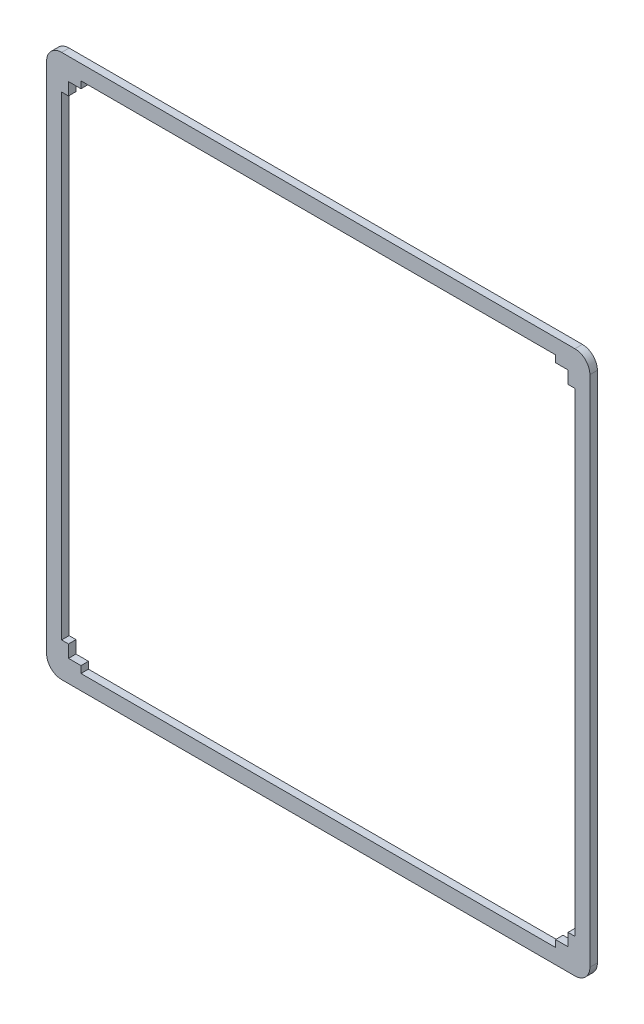
ISO-10303-21;
HEADER;
FILE_DESCRIPTION(('STEP AP214'),'2;1');
FILE_NAME('part.step','',(''),(''),'','','');
FILE_SCHEMA(('AUTOMOTIVE_DESIGN { 1 0 10303 214 1 1 1 1 }'));
ENDSEC;
DATA;
#1=APPLICATION_CONTEXT('core data for automotive mechanical design processes');
#2=APPLICATION_PROTOCOL_DEFINITION('international standard','automotive_design',2000,#1);
#3=PRODUCT_CONTEXT('',#1,'mechanical');
#4=PRODUCT('Part','Part','',(#3));
#5=PRODUCT_RELATED_PRODUCT_CATEGORY('part','',(#4));
#6=PRODUCT_DEFINITION_FORMATION('','',#4);
#7=PRODUCT_DEFINITION_CONTEXT('part definition',#1,'design');
#8=PRODUCT_DEFINITION('design','',#6,#7);
#9=PRODUCT_DEFINITION_SHAPE('','',#8);
#10=(LENGTH_UNIT() NAMED_UNIT(*) SI_UNIT(.MILLI.,.METRE.));
#11=(NAMED_UNIT(*) PLANE_ANGLE_UNIT() SI_UNIT($,.RADIAN.));
#12=(NAMED_UNIT(*) SI_UNIT($,.STERADIAN.) SOLID_ANGLE_UNIT());
#13=UNCERTAINTY_MEASURE_WITH_UNIT(LENGTH_MEASURE(1.E-05),#10,'distance_accuracy_value','');
#14=(GEOMETRIC_REPRESENTATION_CONTEXT(3) GLOBAL_UNCERTAINTY_ASSIGNED_CONTEXT((#13)) GLOBAL_UNIT_ASSIGNED_CONTEXT((#10,
#11,#12)) REPRESENTATION_CONTEXT('',''));
#15=CARTESIAN_POINT('',(0.,0.,0.));
#16=DIRECTION('',(0.,0.,1.));
#17=DIRECTION('',(1.,0.,0.));
#18=AXIS2_PLACEMENT_3D('',#15,#16,#17);
#19=CARTESIAN_POINT('',(-8.75,0.,3.));
#20=DIRECTION('',(1.,0.,0.));
#21=DIRECTION('',(0.,1.,0.));
#22=AXIS2_PLACEMENT_3D('',#19,#20,#21);
#23=PLANE('',#22);
#24=DIRECTION('',(0.,-1.,0.));
#25=VECTOR('',#24,1.);
#26=CARTESIAN_POINT('',(-8.75,0.,0.));
#27=LINE('',#26,#25);
#28=CARTESIAN_POINT('',(-8.75000000000003,202.75,0.));
#29=VERTEX_POINT('',#28);
#30=CARTESIAN_POINT('',(-8.75,-2.74999999999999,0.));
#31=VERTEX_POINT('',#30);
#32=EDGE_CURVE('E344',#29,#31,#27,.T.);
#33=ORIENTED_EDGE('',*,*,#32,.T.);
#34=DIRECTION('',(0.,0.,-1.));
#35=VECTOR('',#34,1.);
#36=CARTESIAN_POINT('',(-8.75,-2.74999999999999,3.));
#37=LINE('',#36,#35);
#38=CARTESIAN_POINT('',(-8.75,-2.74999999999999,3.));
#39=VERTEX_POINT('',#38);
#40=EDGE_CURVE('E11',#39,#31,#37,.T.);
#41=ORIENTED_EDGE('',*,*,#40,.F.);
#42=DIRECTION('',(0.,-1.,0.));
#43=VECTOR('',#42,1.);
#44=CARTESIAN_POINT('',(-8.75,0.,3.));
#45=LINE('',#44,#43);
#46=CARTESIAN_POINT('',(-8.75000000000003,202.75,3.));
#47=VERTEX_POINT('',#46);
#48=EDGE_CURVE('E930',#47,#39,#45,.T.);
#49=ORIENTED_EDGE('',*,*,#48,.F.);
#50=DIRECTION('',(0.,0.,-1.));
#51=VECTOR('',#50,1.);
#52=CARTESIAN_POINT('',(-8.75000000000003,202.75,3.));
#53=LINE('',#52,#51);
#54=EDGE_CURVE('E61',#47,#29,#53,.T.);
#55=ORIENTED_EDGE('',*,*,#54,.T.);
#56=EDGE_LOOP('',(#33,#41,#49,#55));
#57=FACE_BOUND('',#56,.T.);
#58=ADVANCED_FACE('F41',(#57),#23,.F.);
#59=CARTESIAN_POINT('',(-2.75,-2.75,3.));
#60=DIRECTION('',(0.,0.,-1.));
#61=DIRECTION('',(-1.,0.,0.));
#62=AXIS2_PLACEMENT_3D('',#59,#60,#61);
#63=CYLINDRICAL_SURFACE('',#62,5.99999999999999);
#64=CARTESIAN_POINT('',(-2.75,-2.75,0.));
#65=DIRECTION('',(0.,0.,1.));
#66=DIRECTION('',(1.,0.,0.));
#67=AXIS2_PLACEMENT_3D('',#64,#65,#66);
#68=CIRCLE('',#67,5.99999999999999);
#69=CARTESIAN_POINT('',(-2.75000000000004,-8.74999999999999,0.));
#70=VERTEX_POINT('',#69);
#71=EDGE_CURVE('E347',#31,#70,#68,.T.);
#72=ORIENTED_EDGE('',*,*,#71,.T.);
#73=DIRECTION('',(0.,0.,-1.));
#74=VECTOR('',#73,1.);
#75=CARTESIAN_POINT('',(-2.75000000000004,-8.74999999999999,3.));
#76=LINE('',#75,#74);
#77=CARTESIAN_POINT('',(-2.75000000000004,-8.74999999999999,3.));
#78=VERTEX_POINT('',#77);
#79=EDGE_CURVE('E52',#78,#70,#76,.T.);
#80=ORIENTED_EDGE('',*,*,#79,.F.);
#81=CARTESIAN_POINT('',(-2.75,-2.75,3.));
#82=DIRECTION('',(0.,0.,1.));
#83=DIRECTION('',(1.,0.,0.));
#84=AXIS2_PLACEMENT_3D('',#81,#82,#83);
#85=CIRCLE('',#84,5.99999999999999);
#86=EDGE_CURVE('E927',#39,#78,#85,.T.);
#87=ORIENTED_EDGE('',*,*,#86,.F.);
#88=ORIENTED_EDGE('',*,*,#40,.T.);
#89=EDGE_LOOP('',(#72,#80,#87,#88));
#90=FACE_BOUND('',#89,.T.);
#91=ADVANCED_FACE('F559',(#90),#63,.T.);
#92=CARTESIAN_POINT('',(0.,-8.74999999999999,3.));
#93=DIRECTION('',(0.,1.,0.));
#94=DIRECTION('',(-1.,0.,0.));
#95=AXIS2_PLACEMENT_3D('',#92,#93,#94);
#96=PLANE('',#95);
#97=DIRECTION('',(1.,0.,0.));
#98=VECTOR('',#97,1.);
#99=CARTESIAN_POINT('',(0.,-8.74999999999999,0.));
#100=LINE('',#99,#98);
#101=CARTESIAN_POINT('',(202.75,-8.75,0.));
#102=VERTEX_POINT('',#101);
#103=EDGE_CURVE('E350',#70,#102,#100,.T.);
#104=ORIENTED_EDGE('',*,*,#103,.T.);
#105=DIRECTION('',(0.,0.,-1.));
#106=VECTOR('',#105,1.);
#107=CARTESIAN_POINT('',(202.75,-8.75,3.));
#108=LINE('',#107,#106);
#109=CARTESIAN_POINT('',(202.75,-8.75,3.));
#110=VERTEX_POINT('',#109);
#111=EDGE_CURVE('E379',#110,#102,#108,.T.);
#112=ORIENTED_EDGE('',*,*,#111,.F.);
#113=DIRECTION('',(1.,0.,0.));
#114=VECTOR('',#113,1.);
#115=CARTESIAN_POINT('',(0.,-8.74999999999999,3.));
#116=LINE('',#115,#114);
#117=EDGE_CURVE('E922',#78,#110,#116,.T.);
#118=ORIENTED_EDGE('',*,*,#117,.F.);
#119=ORIENTED_EDGE('',*,*,#79,.T.);
#120=EDGE_LOOP('',(#104,#112,#118,#119));
#121=FACE_BOUND('',#120,.T.);
#122=ADVANCED_FACE('F564',(#121),#96,.F.);
#123=CARTESIAN_POINT('',(202.75,-2.74999999999998,3.));
#124=DIRECTION('',(0.,0.,-1.));
#125=DIRECTION('',(-1.,0.,0.));
#126=AXIS2_PLACEMENT_3D('',#123,#124,#125);
#127=CYLINDRICAL_SURFACE('',#126,6.00000000000003);
#128=CARTESIAN_POINT('',(202.75,-2.74999999999998,0.));
#129=DIRECTION('',(0.,0.,1.));
#130=DIRECTION('',(1.,0.,0.));
#131=AXIS2_PLACEMENT_3D('',#128,#129,#130);
#132=CIRCLE('',#131,6.00000000000003);
#133=CARTESIAN_POINT('',(208.75,-2.75,0.));
#134=VERTEX_POINT('',#133);
#135=EDGE_CURVE('E353',#102,#134,#132,.T.);
#136=ORIENTED_EDGE('',*,*,#135,.T.);
#137=DIRECTION('',(0.,0.,-1.));
#138=VECTOR('',#137,1.);
#139=CARTESIAN_POINT('',(208.75,-2.75,3.));
#140=LINE('',#139,#138);
#141=CARTESIAN_POINT('',(208.75,-2.75,3.));
#142=VERTEX_POINT('',#141);
#143=EDGE_CURVE('E375',#142,#134,#140,.T.);
#144=ORIENTED_EDGE('',*,*,#143,.F.);
#145=CARTESIAN_POINT('',(202.75,-2.74999999999998,3.));
#146=DIRECTION('',(0.,0.,1.));
#147=DIRECTION('',(1.,0.,0.));
#148=AXIS2_PLACEMENT_3D('',#145,#146,#147);
#149=CIRCLE('',#148,6.00000000000003);
#150=EDGE_CURVE('E918',#110,#142,#149,.T.);
#151=ORIENTED_EDGE('',*,*,#150,.F.);
#152=ORIENTED_EDGE('',*,*,#111,.T.);
#153=EDGE_LOOP('',(#136,#144,#151,#152));
#154=FACE_BOUND('',#153,.T.);
#155=ADVANCED_FACE('F879',(#154),#127,.T.);
#156=CARTESIAN_POINT('',(208.75,0.,3.));
#157=DIRECTION('',(-1.,0.,0.));
#158=DIRECTION('',(0.,-1.,0.));
#159=AXIS2_PLACEMENT_3D('',#156,#157,#158);
#160=PLANE('',#159);
#161=DIRECTION('',(0.,1.,0.));
#162=VECTOR('',#161,1.);
#163=CARTESIAN_POINT('',(208.75,0.,0.));
#164=LINE('',#163,#162);
#165=CARTESIAN_POINT('',(208.75,202.75,0.));
#166=VERTEX_POINT('',#165);
#167=EDGE_CURVE('E356',#134,#166,#164,.T.);
#168=ORIENTED_EDGE('',*,*,#167,.T.);
#169=DIRECTION('',(0.,0.,-1.));
#170=VECTOR('',#169,1.);
#171=CARTESIAN_POINT('',(208.75,202.75,3.));
#172=LINE('',#171,#170);
#173=CARTESIAN_POINT('',(208.75,202.75,3.));
#174=VERTEX_POINT('',#173);
#175=EDGE_CURVE('E257',#174,#166,#172,.T.);
#176=ORIENTED_EDGE('',*,*,#175,.F.);
#177=DIRECTION('',(0.,1.,0.));
#178=VECTOR('',#177,1.);
#179=CARTESIAN_POINT('',(208.75,0.,3.));
#180=LINE('',#179,#178);
#181=EDGE_CURVE('E243',#142,#174,#180,.T.);
#182=ORIENTED_EDGE('',*,*,#181,.F.);
#183=ORIENTED_EDGE('',*,*,#143,.T.);
#184=EDGE_LOOP('',(#168,#176,#182,#183));
#185=FACE_BOUND('',#184,.T.);
#186=ADVANCED_FACE('F870',(#185),#160,.F.);
#187=CARTESIAN_POINT('',(202.75,202.75,3.));
#188=DIRECTION('',(0.,0.,-1.));
#189=DIRECTION('',(-1.,0.,0.));
#190=AXIS2_PLACEMENT_3D('',#187,#188,#189);
#191=CYLINDRICAL_SURFACE('',#190,6.00000000000007);
#192=CARTESIAN_POINT('',(202.75,202.75,0.));
#193=DIRECTION('',(0.,0.,1.));
#194=DIRECTION('',(1.,0.,0.));
#195=AXIS2_PLACEMENT_3D('',#192,#193,#194);
#196=CIRCLE('',#195,6.00000000000007);
#197=CARTESIAN_POINT('',(202.75,208.75,0.));
#198=VERTEX_POINT('',#197);
#199=EDGE_CURVE('E253',#166,#198,#196,.T.);
#200=ORIENTED_EDGE('',*,*,#199,.T.);
#201=DIRECTION('',(0.,0.,-1.));
#202=VECTOR('',#201,1.);
#203=CARTESIAN_POINT('',(202.75,208.75,3.));
#204=LINE('',#203,#202);
#205=CARTESIAN_POINT('',(202.75,208.75,3.));
#206=VERTEX_POINT('',#205);
#207=EDGE_CURVE('E250',#206,#198,#204,.T.);
#208=ORIENTED_EDGE('',*,*,#207,.F.);
#209=CARTESIAN_POINT('',(202.75,202.75,3.));
#210=DIRECTION('',(0.,0.,1.));
#211=DIRECTION('',(1.,0.,0.));
#212=AXIS2_PLACEMENT_3D('',#209,#210,#211);
#213=CIRCLE('',#212,6.00000000000007);
#214=EDGE_CURVE('E235',#174,#206,#213,.T.);
#215=ORIENTED_EDGE('',*,*,#214,.F.);
#216=ORIENTED_EDGE('',*,*,#175,.T.);
#217=EDGE_LOOP('',(#200,#208,#215,#216));
#218=FACE_BOUND('',#217,.T.);
#219=ADVANCED_FACE('F251',(#218),#191,.T.);
#220=CARTESIAN_POINT('',(0.,208.75,3.));
#221=DIRECTION('',(0.,-1.,0.));
#222=DIRECTION('',(1.,0.,0.));
#223=AXIS2_PLACEMENT_3D('',#220,#221,#222);
#224=PLANE('',#223);
#225=DIRECTION('',(-1.,0.,0.));
#226=VECTOR('',#225,1.);
#227=CARTESIAN_POINT('',(0.,208.75,0.));
#228=LINE('',#227,#226);
#229=CARTESIAN_POINT('',(-2.75000000000003,208.75,0.));
#230=VERTEX_POINT('',#229);
#231=EDGE_CURVE('E361',#198,#230,#228,.T.);
#232=ORIENTED_EDGE('',*,*,#231,.T.);
#233=DIRECTION('',(0.,0.,-1.));
#234=VECTOR('',#233,1.);
#235=CARTESIAN_POINT('',(-2.75000000000003,208.75,3.));
#236=LINE('',#235,#234);
#237=CARTESIAN_POINT('',(-2.75000000000003,208.75,3.));
#238=VERTEX_POINT('',#237);
#239=EDGE_CURVE('E148',#238,#230,#236,.T.);
#240=ORIENTED_EDGE('',*,*,#239,.F.);
#241=DIRECTION('',(-1.,0.,0.));
#242=VECTOR('',#241,1.);
#243=CARTESIAN_POINT('',(0.,208.75,3.));
#244=LINE('',#243,#242);
#245=EDGE_CURVE('E241',#206,#238,#244,.T.);
#246=ORIENTED_EDGE('',*,*,#245,.F.);
#247=ORIENTED_EDGE('',*,*,#207,.T.);
#248=EDGE_LOOP('',(#232,#240,#246,#247));
#249=FACE_BOUND('',#248,.T.);
#250=ADVANCED_FACE('F259',(#249),#224,.F.);
#251=CARTESIAN_POINT('',(5.,0.,3.));
#252=DIRECTION('',(1.,0.,0.));
#253=DIRECTION('',(0.,0.,-1.));
#254=AXIS2_PLACEMENT_3D('',#251,#252,#253);
#255=PLANE('',#254);
#256=DIRECTION('',(0.,-1.,0.));
#257=VECTOR('',#256,1.);
#258=CARTESIAN_POINT('',(5.,0.,0.));
#259=LINE('',#258,#257);
#260=CARTESIAN_POINT('',(5.,202.75,0.));
#261=VERTEX_POINT('',#260);
#262=CARTESIAN_POINT('',(5.,200.,0.));
#263=VERTEX_POINT('',#262);
#264=EDGE_CURVE('E268',#261,#263,#259,.T.);
#265=ORIENTED_EDGE('',*,*,#264,.F.);
#266=DIRECTION('',(0.,0.,-1.));
#267=VECTOR('',#266,1.);
#268=CARTESIAN_POINT('',(5.,202.75,3.));
#269=LINE('',#268,#267);
#270=CARTESIAN_POINT('',(5.,202.75,3.));
#271=VERTEX_POINT('',#270);
#272=EDGE_CURVE('E45',#271,#261,#269,.T.);
#273=ORIENTED_EDGE('',*,*,#272,.F.);
#274=DIRECTION('',(0.,-1.,0.));
#275=VECTOR('',#274,1.);
#276=CARTESIAN_POINT('',(5.,0.,3.));
#277=LINE('',#276,#275);
#278=CARTESIAN_POINT('',(5.,200.,3.));
#279=VERTEX_POINT('',#278);
#280=EDGE_CURVE('E368',#271,#279,#277,.T.);
#281=ORIENTED_EDGE('',*,*,#280,.T.);
#282=DIRECTION('',(0.,0.,-1.));
#283=VECTOR('',#282,1.);
#284=CARTESIAN_POINT('',(5.,200.,3.));
#285=LINE('',#284,#283);
#286=EDGE_CURVE('E264',#279,#263,#285,.T.);
#287=ORIENTED_EDGE('',*,*,#286,.T.);
#288=EDGE_LOOP('',(#265,#273,#281,#287));
#289=FACE_BOUND('',#288,.T.);
#290=ADVANCED_FACE('F43',(#289),#255,.T.);
#291=CARTESIAN_POINT('',(0.,202.75,3.));
#292=DIRECTION('',(0.,1.,0.));
#293=DIRECTION('',(0.,0.,1.));
#294=AXIS2_PLACEMENT_3D('',#291,#292,#293);
#295=PLANE('',#294);
#296=DIRECTION('',(1.,0.,0.));
#297=VECTOR('',#296,1.);
#298=CARTESIAN_POINT('',(0.,202.75,0.));
#299=LINE('',#298,#297);
#300=CARTESIAN_POINT('',(195.,202.75,0.));
#301=VERTEX_POINT('',#300);
#302=EDGE_CURVE('E272',#261,#301,#299,.T.);
#303=ORIENTED_EDGE('',*,*,#302,.T.);
#304=DIRECTION('',(0.,0.,-1.));
#305=VECTOR('',#304,1.);
#306=CARTESIAN_POINT('',(195.,202.75,3.));
#307=LINE('',#306,#305);
#308=CARTESIAN_POINT('',(195.,202.75,3.));
#309=VERTEX_POINT('',#308);
#310=EDGE_CURVE('E441',#309,#301,#307,.T.);
#311=ORIENTED_EDGE('',*,*,#310,.F.);
#312=DIRECTION('',(1.,0.,0.));
#313=VECTOR('',#312,1.);
#314=CARTESIAN_POINT('',(0.,202.75,3.));
#315=LINE('',#314,#313);
#316=EDGE_CURVE('E452',#271,#309,#315,.T.);
#317=ORIENTED_EDGE('',*,*,#316,.F.);
#318=ORIENTED_EDGE('',*,*,#272,.T.);
#319=EDGE_LOOP('',(#303,#311,#317,#318));
#320=FACE_BOUND('',#319,.T.);
#321=ADVANCED_FACE('F451',(#320),#295,.F.);
#322=CARTESIAN_POINT('',(195.,0.,3.));
#323=DIRECTION('',(1.,0.,0.));
#324=DIRECTION('',(0.,0.,-1.));
#325=AXIS2_PLACEMENT_3D('',#322,#323,#324);
#326=PLANE('',#325);
#327=DIRECTION('',(0.,-1.,0.));
#328=VECTOR('',#327,1.);
#329=CARTESIAN_POINT('',(195.,0.,0.));
#330=LINE('',#329,#328);
#331=CARTESIAN_POINT('',(195.,200.,0.));
#332=VERTEX_POINT('',#331);
#333=EDGE_CURVE('E275',#301,#332,#330,.T.);
#334=ORIENTED_EDGE('',*,*,#333,.T.);
#335=DIRECTION('',(0.,0.,-1.));
#336=VECTOR('',#335,1.);
#337=CARTESIAN_POINT('',(195.,200.,3.));
#338=LINE('',#337,#336);
#339=CARTESIAN_POINT('',(195.,200.,3.));
#340=VERTEX_POINT('',#339);
#341=EDGE_CURVE('E439',#340,#332,#338,.T.);
#342=ORIENTED_EDGE('',*,*,#341,.F.);
#343=DIRECTION('',(0.,-1.,0.));
#344=VECTOR('',#343,1.);
#345=CARTESIAN_POINT('',(195.,0.,3.));
#346=LINE('',#345,#344);
#347=EDGE_CURVE('E975',#309,#340,#346,.T.);
#348=ORIENTED_EDGE('',*,*,#347,.F.);
#349=ORIENTED_EDGE('',*,*,#310,.T.);
#350=EDGE_LOOP('',(#334,#342,#348,#349));
#351=FACE_BOUND('',#350,.T.);
#352=ADVANCED_FACE('F550',(#351),#326,.F.);
#353=CARTESIAN_POINT('',(0.,200.,3.));
#354=DIRECTION('',(0.,-1.,0.));
#355=DIRECTION('',(0.,0.,-1.));
#356=AXIS2_PLACEMENT_3D('',#353,#354,#355);
#357=PLANE('',#356);
#358=DIRECTION('',(-1.,0.,0.));
#359=VECTOR('',#358,1.);
#360=CARTESIAN_POINT('',(0.,200.,0.));
#361=LINE('',#360,#359);
#362=CARTESIAN_POINT('',(200.,200.,0.));
#363=VERTEX_POINT('',#362);
#364=EDGE_CURVE('E279',#363,#332,#361,.T.);
#365=ORIENTED_EDGE('',*,*,#364,.F.);
#366=DIRECTION('',(0.,0.,-1.));
#367=VECTOR('',#366,1.);
#368=CARTESIAN_POINT('',(200.,200.,3.));
#369=LINE('',#368,#367);
#370=CARTESIAN_POINT('',(200.,200.,3.));
#371=VERTEX_POINT('',#370);
#372=EDGE_CURVE('E436',#371,#363,#369,.T.);
#373=ORIENTED_EDGE('',*,*,#372,.F.);
#374=DIRECTION('',(-1.,0.,0.));
#375=VECTOR('',#374,1.);
#376=CARTESIAN_POINT('',(0.,200.,3.));
#377=LINE('',#376,#375);
#378=EDGE_CURVE('E549',#371,#340,#377,.T.);
#379=ORIENTED_EDGE('',*,*,#378,.T.);
#380=ORIENTED_EDGE('',*,*,#341,.T.);
#381=EDGE_LOOP('',(#365,#373,#379,#380));
#382=FACE_BOUND('',#381,.T.);
#383=ADVANCED_FACE('F545',(#382),#357,.T.);
#384=CARTESIAN_POINT('',(200.,0.,3.));
#385=DIRECTION('',(1.,0.,0.));
#386=DIRECTION('',(0.,0.,-1.));
#387=AXIS2_PLACEMENT_3D('',#384,#385,#386);
#388=PLANE('',#387);
#389=DIRECTION('',(0.,-1.,0.));
#390=VECTOR('',#389,1.);
#391=CARTESIAN_POINT('',(200.,0.,0.));
#392=LINE('',#391,#390);
#393=CARTESIAN_POINT('',(200.,195.,0.));
#394=VERTEX_POINT('',#393);
#395=EDGE_CURVE('E283',#363,#394,#392,.T.);
#396=ORIENTED_EDGE('',*,*,#395,.T.);
#397=DIRECTION('',(0.,0.,-1.));
#398=VECTOR('',#397,1.);
#399=CARTESIAN_POINT('',(200.,195.,3.));
#400=LINE('',#399,#398);
#401=CARTESIAN_POINT('',(200.,195.,3.));
#402=VERTEX_POINT('',#401);
#403=EDGE_CURVE('E433',#402,#394,#400,.T.);
#404=ORIENTED_EDGE('',*,*,#403,.F.);
#405=DIRECTION('',(0.,-1.,0.));
#406=VECTOR('',#405,1.);
#407=CARTESIAN_POINT('',(200.,0.,3.));
#408=LINE('',#407,#406);
#409=EDGE_CURVE('E970',#371,#402,#408,.T.);
#410=ORIENTED_EDGE('',*,*,#409,.F.);
#411=ORIENTED_EDGE('',*,*,#372,.T.);
#412=EDGE_LOOP('',(#396,#404,#410,#411));
#413=FACE_BOUND('',#412,.T.);
#414=ADVANCED_FACE('F542',(#413),#388,.F.);
#415=CARTESIAN_POINT('',(-1.96812263456276E-12,194.999999999998,3.));
#416=DIRECTION('',(0.,-1.,0.));
#417=DIRECTION('',(1.,0.,0.));
#418=AXIS2_PLACEMENT_3D('',#415,#416,#417);
#419=PLANE('',#418);
#420=DIRECTION('',(-1.,0.,0.));
#421=VECTOR('',#420,1.);
#422=CARTESIAN_POINT('',(-1.96812263456276E-12,194.999999999998,0.));
#423=LINE('',#422,#421);
#424=CARTESIAN_POINT('',(202.75,195.,0.));
#425=VERTEX_POINT('',#424);
#426=EDGE_CURVE('E287',#425,#394,#423,.T.);
#427=ORIENTED_EDGE('',*,*,#426,.F.);
#428=DIRECTION('',(0.,0.,-1.));
#429=VECTOR('',#428,1.);
#430=CARTESIAN_POINT('',(202.75,195.,3.));
#431=LINE('',#430,#429);
#432=CARTESIAN_POINT('',(202.75,195.,3.));
#433=VERTEX_POINT('',#432);
#434=EDGE_CURVE('E430',#433,#425,#431,.T.);
#435=ORIENTED_EDGE('',*,*,#434,.F.);
#436=DIRECTION('',(-1.,0.,0.));
#437=VECTOR('',#436,1.);
#438=CARTESIAN_POINT('',(-1.96812263456276E-12,194.999999999998,3.));
#439=LINE('',#438,#437);
#440=EDGE_CURVE('E539',#433,#402,#439,.T.);
#441=ORIENTED_EDGE('',*,*,#440,.T.);
#442=ORIENTED_EDGE('',*,*,#403,.T.);
#443=EDGE_LOOP('',(#427,#435,#441,#442));
#444=FACE_BOUND('',#443,.T.);
#445=ADVANCED_FACE('F534',(#444),#419,.T.);
#446=CARTESIAN_POINT('',(202.75,0.,3.));
#447=DIRECTION('',(1.,0.,0.));
#448=DIRECTION('',(0.,0.,-1.));
#449=AXIS2_PLACEMENT_3D('',#446,#447,#448);
#450=PLANE('',#449);
#451=DIRECTION('',(0.,-1.,0.));
#452=VECTOR('',#451,1.);
#453=CARTESIAN_POINT('',(202.75,0.,0.));
#454=LINE('',#453,#452);
#455=CARTESIAN_POINT('',(202.75,5.,0.));
#456=VERTEX_POINT('',#455);
#457=EDGE_CURVE('E291',#425,#456,#454,.T.);
#458=ORIENTED_EDGE('',*,*,#457,.T.);
#459=DIRECTION('',(0.,0.,-1.));
#460=VECTOR('',#459,1.);
#461=CARTESIAN_POINT('',(202.75,5.,3.));
#462=LINE('',#461,#460);
#463=CARTESIAN_POINT('',(202.75,5.,3.));
#464=VERTEX_POINT('',#463);
#465=EDGE_CURVE('E427',#464,#456,#462,.T.);
#466=ORIENTED_EDGE('',*,*,#465,.F.);
#467=DIRECTION('',(0.,-1.,0.));
#468=VECTOR('',#467,1.);
#469=CARTESIAN_POINT('',(202.75,0.,3.));
#470=LINE('',#469,#468);
#471=EDGE_CURVE('E965',#433,#464,#470,.T.);
#472=ORIENTED_EDGE('',*,*,#471,.F.);
#473=ORIENTED_EDGE('',*,*,#434,.T.);
#474=EDGE_LOOP('',(#458,#466,#472,#473));
#475=FACE_BOUND('',#474,.T.);
#476=ADVANCED_FACE('F597',(#475),#450,.F.);
#477=CARTESIAN_POINT('',(0.,4.99999999999981,3.));
#478=DIRECTION('',(0.,1.,0.));
#479=DIRECTION('',(-1.,0.,0.));
#480=AXIS2_PLACEMENT_3D('',#477,#478,#479);
#481=PLANE('',#480);
#482=DIRECTION('',(1.,0.,0.));
#483=VECTOR('',#482,1.);
#484=CARTESIAN_POINT('',(0.,4.99999999999981,0.));
#485=LINE('',#484,#483);
#486=CARTESIAN_POINT('',(200.,5.,0.));
#487=VERTEX_POINT('',#486);
#488=EDGE_CURVE('E295',#487,#456,#485,.T.);
#489=ORIENTED_EDGE('',*,*,#488,.F.);
#490=DIRECTION('',(0.,0.,-1.));
#491=VECTOR('',#490,1.);
#492=CARTESIAN_POINT('',(200.,5.,3.));
#493=LINE('',#492,#491);
#494=CARTESIAN_POINT('',(200.,5.,3.));
#495=VERTEX_POINT('',#494);
#496=EDGE_CURVE('E424',#495,#487,#493,.T.);
#497=ORIENTED_EDGE('',*,*,#496,.F.);
#498=DIRECTION('',(1.,0.,0.));
#499=VECTOR('',#498,1.);
#500=CARTESIAN_POINT('',(0.,4.99999999999981,3.));
#501=LINE('',#500,#499);
#502=EDGE_CURVE('E962',#495,#464,#501,.T.);
#503=ORIENTED_EDGE('',*,*,#502,.T.);
#504=ORIENTED_EDGE('',*,*,#465,.T.);
#505=EDGE_LOOP('',(#489,#497,#503,#504));
#506=FACE_BOUND('',#505,.T.);
#507=ADVANCED_FACE('F527',(#506),#481,.T.);
#508=CARTESIAN_POINT('',(200.,0.,3.));
#509=DIRECTION('',(-1.,0.,0.));
#510=DIRECTION('',(0.,0.,1.));
#511=AXIS2_PLACEMENT_3D('',#508,#509,#510);
#512=PLANE('',#511);
#513=DIRECTION('',(0.,1.,0.));
#514=VECTOR('',#513,1.);
#515=CARTESIAN_POINT('',(200.,0.,0.));
#516=LINE('',#515,#514);
#517=CARTESIAN_POINT('',(200.,0.,0.));
#518=VERTEX_POINT('',#517);
#519=EDGE_CURVE('E299',#518,#487,#516,.T.);
#520=ORIENTED_EDGE('',*,*,#519,.F.);
#521=DIRECTION('',(0.,0.,-1.));
#522=VECTOR('',#521,1.);
#523=CARTESIAN_POINT('',(200.,0.,3.));
#524=LINE('',#523,#522);
#525=CARTESIAN_POINT('',(200.,0.,3.));
#526=VERTEX_POINT('',#525);
#527=EDGE_CURVE('E421',#526,#518,#524,.T.);
#528=ORIENTED_EDGE('',*,*,#527,.F.);
#529=DIRECTION('',(0.,1.,0.));
#530=VECTOR('',#529,1.);
#531=CARTESIAN_POINT('',(200.,0.,3.));
#532=LINE('',#531,#530);
#533=EDGE_CURVE('E523',#526,#495,#532,.T.);
#534=ORIENTED_EDGE('',*,*,#533,.T.);
#535=ORIENTED_EDGE('',*,*,#496,.T.);
#536=EDGE_LOOP('',(#520,#528,#534,#535));
#537=FACE_BOUND('',#536,.T.);
#538=ADVANCED_FACE('F520',(#537),#512,.T.);
#539=CARTESIAN_POINT('',(0.,0.,3.));
#540=DIRECTION('',(0.,-1.,0.));
#541=DIRECTION('',(0.,0.,-1.));
#542=AXIS2_PLACEMENT_3D('',#539,#540,#541);
#543=PLANE('',#542);
#544=DIRECTION('',(-1.,0.,0.));
#545=VECTOR('',#544,1.);
#546=CARTESIAN_POINT('',(0.,0.,0.));
#547=LINE('',#546,#545);
#548=CARTESIAN_POINT('',(195.,0.,0.));
#549=VERTEX_POINT('',#548);
#550=EDGE_CURVE('E303',#518,#549,#547,.T.);
#551=ORIENTED_EDGE('',*,*,#550,.T.);
#552=DIRECTION('',(0.,0.,-1.));
#553=VECTOR('',#552,1.);
#554=CARTESIAN_POINT('',(195.,0.,3.));
#555=LINE('',#554,#553);
#556=CARTESIAN_POINT('',(195.,0.,3.));
#557=VERTEX_POINT('',#556);
#558=EDGE_CURVE('E417',#557,#549,#555,.T.);
#559=ORIENTED_EDGE('',*,*,#558,.F.);
#560=DIRECTION('',(-1.,0.,0.));
#561=VECTOR('',#560,1.);
#562=CARTESIAN_POINT('',(0.,0.,3.));
#563=LINE('',#562,#561);
#564=EDGE_CURVE('E516',#526,#557,#563,.T.);
#565=ORIENTED_EDGE('',*,*,#564,.F.);
#566=ORIENTED_EDGE('',*,*,#527,.T.);
#567=EDGE_LOOP('',(#551,#559,#565,#566));
#568=FACE_BOUND('',#567,.T.);
#569=ADVANCED_FACE('F515',(#568),#543,.F.);
#570=CARTESIAN_POINT('',(195.,0.,3.));
#571=DIRECTION('',(1.,0.,0.));
#572=DIRECTION('',(0.,0.,-1.));
#573=AXIS2_PLACEMENT_3D('',#570,#571,#572);
#574=PLANE('',#573);
#575=DIRECTION('',(0.,-1.,0.));
#576=VECTOR('',#575,1.);
#577=CARTESIAN_POINT('',(195.,0.,0.));
#578=LINE('',#577,#576);
#579=CARTESIAN_POINT('',(195.,-2.75,0.));
#580=VERTEX_POINT('',#579);
#581=EDGE_CURVE('E306',#549,#580,#578,.T.);
#582=ORIENTED_EDGE('',*,*,#581,.T.);
#583=DIRECTION('',(0.,0.,-1.));
#584=VECTOR('',#583,1.);
#585=CARTESIAN_POINT('',(195.,-2.75,3.));
#586=LINE('',#585,#584);
#587=CARTESIAN_POINT('',(195.,-2.75,3.));
#588=VERTEX_POINT('',#587);
#589=EDGE_CURVE('E413',#588,#580,#586,.T.);
#590=ORIENTED_EDGE('',*,*,#589,.F.);
#591=DIRECTION('',(0.,-1.,0.));
#592=VECTOR('',#591,1.);
#593=CARTESIAN_POINT('',(195.,0.,3.));
#594=LINE('',#593,#592);
#595=EDGE_CURVE('E511',#557,#588,#594,.T.);
#596=ORIENTED_EDGE('',*,*,#595,.F.);
#597=ORIENTED_EDGE('',*,*,#558,.T.);
#598=EDGE_LOOP('',(#582,#590,#596,#597));
#599=FACE_BOUND('',#598,.T.);
#600=ADVANCED_FACE('F510',(#599),#574,.F.);
#601=CARTESIAN_POINT('',(0.,-2.75,3.));
#602=DIRECTION('',(0.,-1.,0.));
#603=DIRECTION('',(0.,0.,-1.));
#604=AXIS2_PLACEMENT_3D('',#601,#602,#603);
#605=PLANE('',#604);
#606=DIRECTION('',(-1.,0.,0.));
#607=VECTOR('',#606,1.);
#608=CARTESIAN_POINT('',(0.,-2.75,0.));
#609=LINE('',#608,#607);
#610=CARTESIAN_POINT('',(5.,-2.75,0.));
#611=VERTEX_POINT('',#610);
#612=EDGE_CURVE('E309',#580,#611,#609,.T.);
#613=ORIENTED_EDGE('',*,*,#612,.T.);
#614=DIRECTION('',(0.,0.,-1.));
#615=VECTOR('',#614,1.);
#616=CARTESIAN_POINT('',(5.,-2.75,3.));
#617=LINE('',#616,#615);
#618=CARTESIAN_POINT('',(5.,-2.75,3.));
#619=VERTEX_POINT('',#618);
#620=EDGE_CURVE('E410',#619,#611,#617,.T.);
#621=ORIENTED_EDGE('',*,*,#620,.F.);
#622=DIRECTION('',(-1.,0.,0.));
#623=VECTOR('',#622,1.);
#624=CARTESIAN_POINT('',(0.,-2.75,3.));
#625=LINE('',#624,#623);
#626=EDGE_CURVE('E507',#588,#619,#625,.T.);
#627=ORIENTED_EDGE('',*,*,#626,.F.);
#628=ORIENTED_EDGE('',*,*,#589,.T.);
#629=EDGE_LOOP('',(#613,#621,#627,#628));
#630=FACE_BOUND('',#629,.T.);
#631=ADVANCED_FACE('F504',(#630),#605,.F.);
#632=CARTESIAN_POINT('',(5.,0.,3.));
#633=DIRECTION('',(1.,0.,0.));
#634=DIRECTION('',(0.,1.,0.));
#635=AXIS2_PLACEMENT_3D('',#632,#633,#634);
#636=PLANE('',#635);
#637=DIRECTION('',(0.,-1.,0.));
#638=VECTOR('',#637,1.);
#639=CARTESIAN_POINT('',(5.,0.,0.));
#640=LINE('',#639,#638);
#641=CARTESIAN_POINT('',(5.,0.,0.));
#642=VERTEX_POINT('',#641);
#643=EDGE_CURVE('E313',#642,#611,#640,.T.);
#644=ORIENTED_EDGE('',*,*,#643,.F.);
#645=DIRECTION('',(0.,0.,-1.));
#646=VECTOR('',#645,1.);
#647=CARTESIAN_POINT('',(5.,0.,3.));
#648=LINE('',#647,#646);
#649=CARTESIAN_POINT('',(5.,0.,3.));
#650=VERTEX_POINT('',#649);
#651=EDGE_CURVE('E407',#650,#642,#648,.T.);
#652=ORIENTED_EDGE('',*,*,#651,.F.);
#653=DIRECTION('',(0.,-1.,0.));
#654=VECTOR('',#653,1.);
#655=CARTESIAN_POINT('',(5.,0.,3.));
#656=LINE('',#655,#654);
#657=EDGE_CURVE('E951',#650,#619,#656,.T.);
#658=ORIENTED_EDGE('',*,*,#657,.T.);
#659=ORIENTED_EDGE('',*,*,#620,.T.);
#660=EDGE_LOOP('',(#644,#652,#658,#659));
#661=FACE_BOUND('',#660,.T.);
#662=ADVANCED_FACE('F498',(#661),#636,.T.);
#663=CARTESIAN_POINT('',(0.,0.,3.));
#664=DIRECTION('',(0.,1.,0.));
#665=DIRECTION('',(0.,0.,1.));
#666=AXIS2_PLACEMENT_3D('',#663,#664,#665);
#667=PLANE('',#666);
#668=DIRECTION('',(1.,0.,0.));
#669=VECTOR('',#668,1.);
#670=CARTESIAN_POINT('',(0.,0.,0.));
#671=LINE('',#670,#669);
#672=CARTESIAN_POINT('',(0.,0.,0.));
#673=VERTEX_POINT('',#672);
#674=EDGE_CURVE('E317',#673,#642,#671,.T.);
#675=ORIENTED_EDGE('',*,*,#674,.F.);
#676=DIRECTION('',(0.,0.,-1.));
#677=VECTOR('',#676,1.);
#678=CARTESIAN_POINT('',(0.,0.,3.));
#679=LINE('',#678,#677);
#680=CARTESIAN_POINT('',(0.,0.,3.));
#681=VERTEX_POINT('',#680);
#682=EDGE_CURVE('E404',#681,#673,#679,.T.);
#683=ORIENTED_EDGE('',*,*,#682,.F.);
#684=DIRECTION('',(1.,0.,0.));
#685=VECTOR('',#684,1.);
#686=CARTESIAN_POINT('',(0.,0.,3.));
#687=LINE('',#686,#685);
#688=EDGE_CURVE('E494',#681,#650,#687,.T.);
#689=ORIENTED_EDGE('',*,*,#688,.T.);
#690=ORIENTED_EDGE('',*,*,#651,.T.);
#691=EDGE_LOOP('',(#675,#683,#689,#690));
#692=FACE_BOUND('',#691,.T.);
#693=ADVANCED_FACE('F489',(#692),#667,.T.);
#694=CARTESIAN_POINT('',(0.,0.,3.));
#695=DIRECTION('',(-1.,0.,0.));
#696=DIRECTION('',(0.,0.,1.));
#697=AXIS2_PLACEMENT_3D('',#694,#695,#696);
#698=PLANE('',#697);
#699=DIRECTION('',(0.,1.,0.));
#700=VECTOR('',#699,1.);
#701=CARTESIAN_POINT('',(0.,0.,0.));
#702=LINE('',#701,#700);
#703=CARTESIAN_POINT('',(0.,5.,0.));
#704=VERTEX_POINT('',#703);
#705=EDGE_CURVE('E321',#673,#704,#702,.T.);
#706=ORIENTED_EDGE('',*,*,#705,.T.);
#707=DIRECTION('',(0.,0.,-1.));
#708=VECTOR('',#707,1.);
#709=CARTESIAN_POINT('',(0.,5.,3.));
#710=LINE('',#709,#708);
#711=CARTESIAN_POINT('',(0.,5.,3.));
#712=VERTEX_POINT('',#711);
#713=EDGE_CURVE('E400',#712,#704,#710,.T.);
#714=ORIENTED_EDGE('',*,*,#713,.F.);
#715=DIRECTION('',(0.,1.,0.));
#716=VECTOR('',#715,1.);
#717=CARTESIAN_POINT('',(0.,0.,3.));
#718=LINE('',#717,#716);
#719=EDGE_CURVE('E946',#681,#712,#718,.T.);
#720=ORIENTED_EDGE('',*,*,#719,.F.);
#721=ORIENTED_EDGE('',*,*,#682,.T.);
#722=EDGE_LOOP('',(#706,#714,#720,#721));
#723=FACE_BOUND('',#722,.T.);
#724=ADVANCED_FACE('F580',(#723),#698,.F.);
#725=CARTESIAN_POINT('',(0.,5.,3.));
#726=DIRECTION('',(0.,-1.,0.));
#727=DIRECTION('',(1.,0.,0.));
#728=AXIS2_PLACEMENT_3D('',#725,#726,#727);
#729=PLANE('',#728);
#730=DIRECTION('',(-1.,0.,0.));
#731=VECTOR('',#730,1.);
#732=CARTESIAN_POINT('',(0.,5.,0.));
#733=LINE('',#732,#731);
#734=CARTESIAN_POINT('',(-2.75,5.,0.));
#735=VERTEX_POINT('',#734);
#736=EDGE_CURVE('E324',#704,#735,#733,.T.);
#737=ORIENTED_EDGE('',*,*,#736,.T.);
#738=DIRECTION('',(0.,0.,-1.));
#739=VECTOR('',#738,1.);
#740=CARTESIAN_POINT('',(-2.75,5.,3.));
#741=LINE('',#740,#739);
#742=CARTESIAN_POINT('',(-2.75,5.,3.));
#743=VERTEX_POINT('',#742);
#744=EDGE_CURVE('E397',#743,#735,#741,.T.);
#745=ORIENTED_EDGE('',*,*,#744,.F.);
#746=DIRECTION('',(-1.,0.,0.));
#747=VECTOR('',#746,1.);
#748=CARTESIAN_POINT('',(0.,5.,3.));
#749=LINE('',#748,#747);
#750=EDGE_CURVE('E943',#712,#743,#749,.T.);
#751=ORIENTED_EDGE('',*,*,#750,.F.);
#752=ORIENTED_EDGE('',*,*,#713,.T.);
#753=EDGE_LOOP('',(#737,#745,#751,#752));
#754=FACE_BOUND('',#753,.T.);
#755=ADVANCED_FACE('F483',(#754),#729,.F.);
#756=CARTESIAN_POINT('',(-2.75,0.,3.));
#757=DIRECTION('',(1.,0.,0.));
#758=DIRECTION('',(0.,0.,-1.));
#759=AXIS2_PLACEMENT_3D('',#756,#757,#758);
#760=PLANE('',#759);
#761=DIRECTION('',(0.,-1.,0.));
#762=VECTOR('',#761,1.);
#763=CARTESIAN_POINT('',(-2.75,0.,0.));
#764=LINE('',#763,#762);
#765=CARTESIAN_POINT('',(-2.75,195.,0.));
#766=VERTEX_POINT('',#765);
#767=EDGE_CURVE('E328',#766,#735,#764,.T.);
#768=ORIENTED_EDGE('',*,*,#767,.F.);
#769=DIRECTION('',(0.,0.,-1.));
#770=VECTOR('',#769,1.);
#771=CARTESIAN_POINT('',(-2.75,195.,3.));
#772=LINE('',#771,#770);
#773=CARTESIAN_POINT('',(-2.75,195.,3.));
#774=VERTEX_POINT('',#773);
#775=EDGE_CURVE('E394',#774,#766,#772,.T.);
#776=ORIENTED_EDGE('',*,*,#775,.F.);
#777=DIRECTION('',(0.,-1.,0.));
#778=VECTOR('',#777,1.);
#779=CARTESIAN_POINT('',(-2.75,0.,3.));
#780=LINE('',#779,#778);
#781=EDGE_CURVE('E480',#774,#743,#780,.T.);
#782=ORIENTED_EDGE('',*,*,#781,.T.);
#783=ORIENTED_EDGE('',*,*,#744,.T.);
#784=EDGE_LOOP('',(#768,#776,#782,#783));
#785=FACE_BOUND('',#784,.T.);
#786=ADVANCED_FACE('F476',(#785),#760,.T.);
#787=CARTESIAN_POINT('',(0.,195.,3.));
#788=DIRECTION('',(0.,1.,0.));
#789=DIRECTION('',(0.,0.,1.));
#790=AXIS2_PLACEMENT_3D('',#787,#788,#789);
#791=PLANE('',#790);
#792=DIRECTION('',(1.,0.,0.));
#793=VECTOR('',#792,1.);
#794=CARTESIAN_POINT('',(0.,195.,0.));
#795=LINE('',#794,#793);
#796=CARTESIAN_POINT('',(0.,195.,0.));
#797=VERTEX_POINT('',#796);
#798=EDGE_CURVE('E332',#766,#797,#795,.T.);
#799=ORIENTED_EDGE('',*,*,#798,.T.);
#800=DIRECTION('',(0.,0.,-1.));
#801=VECTOR('',#800,1.);
#802=CARTESIAN_POINT('',(0.,195.,3.));
#803=LINE('',#802,#801);
#804=CARTESIAN_POINT('',(0.,195.,3.));
#805=VERTEX_POINT('',#804);
#806=EDGE_CURVE('E391',#805,#797,#803,.T.);
#807=ORIENTED_EDGE('',*,*,#806,.F.);
#808=DIRECTION('',(1.,0.,0.));
#809=VECTOR('',#808,1.);
#810=CARTESIAN_POINT('',(0.,195.,3.));
#811=LINE('',#810,#809);
#812=EDGE_CURVE('E938',#774,#805,#811,.T.);
#813=ORIENTED_EDGE('',*,*,#812,.F.);
#814=ORIENTED_EDGE('',*,*,#775,.T.);
#815=EDGE_LOOP('',(#799,#807,#813,#814));
#816=FACE_BOUND('',#815,.T.);
#817=ADVANCED_FACE('F472',(#816),#791,.F.);
#818=CARTESIAN_POINT('',(0.,0.,3.));
#819=DIRECTION('',(1.,0.,0.));
#820=DIRECTION('',(0.,0.,-1.));
#821=AXIS2_PLACEMENT_3D('',#818,#819,#820);
#822=PLANE('',#821);
#823=DIRECTION('',(0.,-1.,0.));
#824=VECTOR('',#823,1.);
#825=CARTESIAN_POINT('',(0.,0.,0.));
#826=LINE('',#825,#824);
#827=CARTESIAN_POINT('',(0.,200.,0.));
#828=VERTEX_POINT('',#827);
#829=EDGE_CURVE('E336',#828,#797,#826,.T.);
#830=ORIENTED_EDGE('',*,*,#829,.F.);
#831=DIRECTION('',(0.,0.,-1.));
#832=VECTOR('',#831,1.);
#833=CARTESIAN_POINT('',(0.,200.,3.));
#834=LINE('',#833,#832);
#835=CARTESIAN_POINT('',(0.,200.,3.));
#836=VERTEX_POINT('',#835);
#837=EDGE_CURVE('E388',#836,#828,#834,.T.);
#838=ORIENTED_EDGE('',*,*,#837,.F.);
#839=DIRECTION('',(0.,-1.,0.));
#840=VECTOR('',#839,1.);
#841=CARTESIAN_POINT('',(0.,0.,3.));
#842=LINE('',#841,#840);
#843=EDGE_CURVE('E469',#836,#805,#842,.T.);
#844=ORIENTED_EDGE('',*,*,#843,.T.);
#845=ORIENTED_EDGE('',*,*,#806,.T.);
#846=EDGE_LOOP('',(#830,#838,#844,#845));
#847=FACE_BOUND('',#846,.T.);
#848=ADVANCED_FACE('F465',(#847),#822,.T.);
#849=CARTESIAN_POINT('',(0.,200.,3.));
#850=DIRECTION('',(0.,1.,0.));
#851=DIRECTION('',(0.,0.,1.));
#852=AXIS2_PLACEMENT_3D('',#849,#850,#851);
#853=PLANE('',#852);
#854=DIRECTION('',(1.,0.,0.));
#855=VECTOR('',#854,1.);
#856=CARTESIAN_POINT('',(0.,200.,0.));
#857=LINE('',#856,#855);
#858=EDGE_CURVE('E340',#828,#263,#857,.T.);
#859=ORIENTED_EDGE('',*,*,#858,.T.);
#860=ORIENTED_EDGE('',*,*,#286,.F.);
#861=DIRECTION('',(1.,0.,0.));
#862=VECTOR('',#861,1.);
#863=CARTESIAN_POINT('',(0.,200.,3.));
#864=LINE('',#863,#862);
#865=EDGE_CURVE('E933',#836,#279,#864,.T.);
#866=ORIENTED_EDGE('',*,*,#865,.F.);
#867=ORIENTED_EDGE('',*,*,#837,.T.);
#868=EDGE_LOOP('',(#859,#860,#866,#867));
#869=FACE_BOUND('',#868,.T.);
#870=ADVANCED_FACE('F461',(#869),#853,.F.);
#871=CARTESIAN_POINT('',(-2.75000000000002,202.75,3.));
#872=DIRECTION('',(0.,0.,-1.));
#873=DIRECTION('',(-1.,0.,0.));
#874=AXIS2_PLACEMENT_3D('',#871,#872,#873);
#875=CYLINDRICAL_SURFACE('',#874,6.00000000000003);
#876=CARTESIAN_POINT('',(-2.75000000000002,202.75,0.));
#877=DIRECTION('',(0.,0.,1.));
#878=DIRECTION('',(1.,0.,0.));
#879=AXIS2_PLACEMENT_3D('',#876,#877,#878);
#880=CIRCLE('',#879,6.00000000000003);
#881=EDGE_CURVE('E364',#29,#230,#880,.F.);
#882=ORIENTED_EDGE('',*,*,#881,.F.);
#883=ORIENTED_EDGE('',*,*,#54,.F.);
#884=CARTESIAN_POINT('',(-2.75000000000002,202.75,3.));
#885=DIRECTION('',(0.,0.,1.));
#886=DIRECTION('',(1.,0.,0.));
#887=AXIS2_PLACEMENT_3D('',#884,#885,#886);
#888=CIRCLE('',#887,6.00000000000003);
#889=EDGE_CURVE('E261',#47,#238,#888,.F.);
#890=ORIENTED_EDGE('',*,*,#889,.T.);
#891=ORIENTED_EDGE('',*,*,#239,.T.);
#892=EDGE_LOOP('',(#882,#883,#890,#891));
#893=FACE_BOUND('',#892,.T.);
#894=ADVANCED_FACE('F571',(#893),#875,.T.);
#895=CARTESIAN_POINT('',(0.,0.,3.));
#896=DIRECTION('',(0.,0.,1.));
#897=DIRECTION('',(1.,0.,0.));
#898=AXIS2_PLACEMENT_3D('',#895,#896,#897);
#899=PLANE('',#898);
#900=ORIENTED_EDGE('',*,*,#280,.F.);
#901=ORIENTED_EDGE('',*,*,#316,.T.);
#902=ORIENTED_EDGE('',*,*,#347,.T.);
#903=ORIENTED_EDGE('',*,*,#378,.F.);
#904=ORIENTED_EDGE('',*,*,#409,.T.);
#905=ORIENTED_EDGE('',*,*,#440,.F.);
#906=ORIENTED_EDGE('',*,*,#471,.T.);
#907=ORIENTED_EDGE('',*,*,#502,.F.);
#908=ORIENTED_EDGE('',*,*,#533,.F.);
#909=ORIENTED_EDGE('',*,*,#564,.T.);
#910=ORIENTED_EDGE('',*,*,#595,.T.);
#911=ORIENTED_EDGE('',*,*,#626,.T.);
#912=ORIENTED_EDGE('',*,*,#657,.F.);
#913=ORIENTED_EDGE('',*,*,#688,.F.);
#914=ORIENTED_EDGE('',*,*,#719,.T.);
#915=ORIENTED_EDGE('',*,*,#750,.T.);
#916=ORIENTED_EDGE('',*,*,#781,.F.);
#917=ORIENTED_EDGE('',*,*,#812,.T.);
#918=ORIENTED_EDGE('',*,*,#843,.F.);
#919=ORIENTED_EDGE('',*,*,#865,.T.);
#920=EDGE_LOOP('',(#900,#901,#902,#903,#904,#905,#906,#907,#908,#909,#910,#911,#912,#913,#914,
#915,#916,#917,#918,#919));
#921=FACE_BOUND('',#920,.T.);
#922=ORIENTED_EDGE('',*,*,#48,.T.);
#923=ORIENTED_EDGE('',*,*,#86,.T.);
#924=ORIENTED_EDGE('',*,*,#117,.T.);
#925=ORIENTED_EDGE('',*,*,#150,.T.);
#926=ORIENTED_EDGE('',*,*,#181,.T.);
#927=ORIENTED_EDGE('',*,*,#214,.T.);
#928=ORIENTED_EDGE('',*,*,#245,.T.);
#929=ORIENTED_EDGE('',*,*,#889,.F.);
#930=EDGE_LOOP('',(#922,#923,#924,#925,#926,#927,#928,#929));
#931=FACE_BOUND('',#930,.T.);
#932=ADVANCED_FACE('F238',(#921,#931),#899,.T.);
#933=CARTESIAN_POINT('',(0.,0.,0.));
#934=DIRECTION('',(0.,0.,1.));
#935=DIRECTION('',(1.,0.,0.));
#936=AXIS2_PLACEMENT_3D('',#933,#934,#935);
#937=PLANE('',#936);
#938=ORIENTED_EDGE('',*,*,#264,.T.);
#939=ORIENTED_EDGE('',*,*,#858,.F.);
#940=ORIENTED_EDGE('',*,*,#829,.T.);
#941=ORIENTED_EDGE('',*,*,#798,.F.);
#942=ORIENTED_EDGE('',*,*,#767,.T.);
#943=ORIENTED_EDGE('',*,*,#736,.F.);
#944=ORIENTED_EDGE('',*,*,#705,.F.);
#945=ORIENTED_EDGE('',*,*,#674,.T.);
#946=ORIENTED_EDGE('',*,*,#643,.T.);
#947=ORIENTED_EDGE('',*,*,#612,.F.);
#948=ORIENTED_EDGE('',*,*,#581,.F.);
#949=ORIENTED_EDGE('',*,*,#550,.F.);
#950=ORIENTED_EDGE('',*,*,#519,.T.);
#951=ORIENTED_EDGE('',*,*,#488,.T.);
#952=ORIENTED_EDGE('',*,*,#457,.F.);
#953=ORIENTED_EDGE('',*,*,#426,.T.);
#954=ORIENTED_EDGE('',*,*,#395,.F.);
#955=ORIENTED_EDGE('',*,*,#364,.T.);
#956=ORIENTED_EDGE('',*,*,#333,.F.);
#957=ORIENTED_EDGE('',*,*,#302,.F.);
#958=EDGE_LOOP('',(#938,#939,#940,#941,#942,#943,#944,#945,#946,#947,#948,#949,#950,#951,#952,
#953,#954,#955,#956,#957));
#959=FACE_BOUND('',#958,.T.);
#960=ORIENTED_EDGE('',*,*,#32,.F.);
#961=ORIENTED_EDGE('',*,*,#881,.T.);
#962=ORIENTED_EDGE('',*,*,#231,.F.);
#963=ORIENTED_EDGE('',*,*,#199,.F.);
#964=ORIENTED_EDGE('',*,*,#167,.F.);
#965=ORIENTED_EDGE('',*,*,#135,.F.);
#966=ORIENTED_EDGE('',*,*,#103,.F.);
#967=ORIENTED_EDGE('',*,*,#71,.F.);
#968=EDGE_LOOP('',(#960,#961,#962,#963,#964,#965,#966,#967));
#969=FACE_BOUND('',#968,.T.);
#970=ADVANCED_FACE('F455',(#959,#969),#937,.F.);
#971=CLOSED_SHELL('',(#58,#91,#122,#155,#186,#219,#250,#290,#321,#352,#383,#414,#445,#476,#507,
#538,#569,#600,#631,#662,#693,#724,#755,#786,#817,#848,#870,#894,#932,#970));
#972=MANIFOLD_SOLID_BREP('B2',#971);
#973=ADVANCED_BREP_SHAPE_REPRESENTATION('',(#18,#972),#14);
#974=SHAPE_DEFINITION_REPRESENTATION(#9,#973);
ENDSEC;
END-ISO-10303-21;
